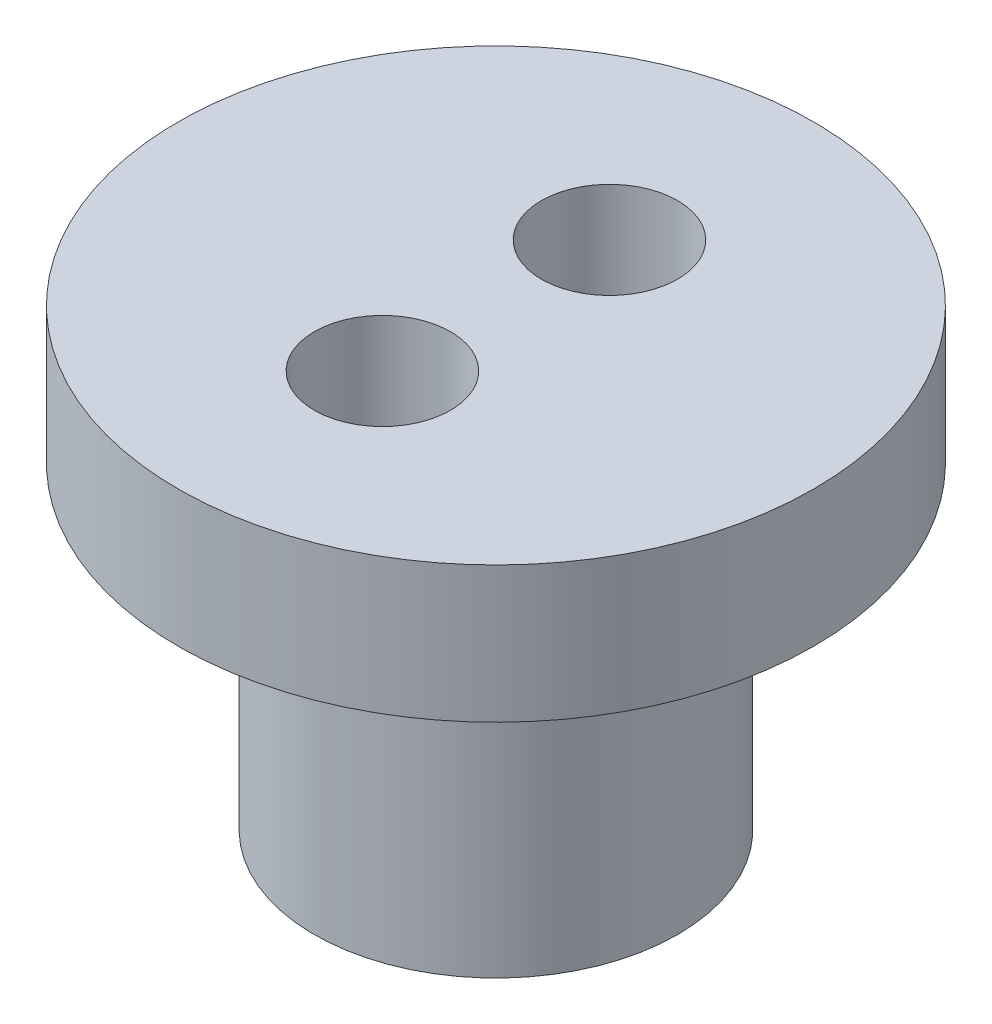
ISO-10303-21;
HEADER;
FILE_DESCRIPTION(('STEP AP214'),'2;1');
FILE_NAME('part.step','',(''),(''),'','','');
FILE_SCHEMA(('AUTOMOTIVE_DESIGN { 1 0 10303 214 1 1 1 1 }'));
ENDSEC;
DATA;
#1=APPLICATION_CONTEXT('core data for automotive mechanical design processes');
#2=APPLICATION_PROTOCOL_DEFINITION('international standard','automotive_design',2000,#1);
#3=PRODUCT_CONTEXT('',#1,'mechanical');
#4=PRODUCT('Part','Part','',(#3));
#5=PRODUCT_RELATED_PRODUCT_CATEGORY('part','',(#4));
#6=PRODUCT_DEFINITION_FORMATION('','',#4);
#7=PRODUCT_DEFINITION_CONTEXT('part definition',#1,'design');
#8=PRODUCT_DEFINITION('design','',#6,#7);
#9=PRODUCT_DEFINITION_SHAPE('','',#8);
#10=(LENGTH_UNIT() NAMED_UNIT(*) SI_UNIT(.MILLI.,.METRE.));
#11=(NAMED_UNIT(*) PLANE_ANGLE_UNIT() SI_UNIT($,.RADIAN.));
#12=(NAMED_UNIT(*) SI_UNIT($,.STERADIAN.) SOLID_ANGLE_UNIT());
#13=UNCERTAINTY_MEASURE_WITH_UNIT(LENGTH_MEASURE(1.E-05),#10,'distance_accuracy_value','');
#14=(GEOMETRIC_REPRESENTATION_CONTEXT(3) GLOBAL_UNCERTAINTY_ASSIGNED_CONTEXT((#13)) GLOBAL_UNIT_ASSIGNED_CONTEXT((#10,
#11,#12)) REPRESENTATION_CONTEXT('',''));
#15=CARTESIAN_POINT('',(0.,0.,0.));
#16=DIRECTION('',(0.,0.,1.));
#17=DIRECTION('',(1.,0.,0.));
#18=AXIS2_PLACEMENT_3D('',#15,#16,#17);
#19=CARTESIAN_POINT('',(4.,0.,0.));
#20=DIRECTION('',(0.,-1.,0.));
#21=DIRECTION('',(1.,0.,0.));
#22=AXIS2_PLACEMENT_3D('',#19,#20,#21);
#23=PLANE('',#22);
#24=CARTESIAN_POINT('',(0.,0.,0.));
#25=DIRECTION('',(0.,-1.,0.));
#26=DIRECTION('',(1.,0.,0.));
#27=AXIS2_PLACEMENT_3D('',#24,#25,#26);
#28=CIRCLE('',#27,4.);
#29=CARTESIAN_POINT('',(4.,0.,0.));
#30=VERTEX_POINT('',#29);
#31=EDGE_CURVE('E74',#30,#30,#28,.T.);
#32=ORIENTED_EDGE('',*,*,#31,.T.);
#33=EDGE_LOOP('',(#32));
#34=FACE_BOUND('',#33,.T.);
#35=CARTESIAN_POINT('',(0.,0.,0.));
#36=DIRECTION('',(0.,-1.,0.));
#37=DIRECTION('',(1.,0.,0.));
#38=AXIS2_PLACEMENT_3D('',#35,#36,#37);
#39=CIRCLE('',#38,2.);
#40=CARTESIAN_POINT('',(2.,0.,0.));
#41=VERTEX_POINT('',#40);
#42=EDGE_CURVE('E54',#41,#41,#39,.T.);
#43=ORIENTED_EDGE('',*,*,#42,.F.);
#44=EDGE_LOOP('',(#43));
#45=FACE_BOUND('',#44,.T.);
#46=ADVANCED_FACE('F40',(#34,#45),#23,.T.);
#47=CARTESIAN_POINT('',(0.,4.,0.));
#48=DIRECTION('',(0.,-1.,0.));
#49=DIRECTION('',(1.,0.,0.));
#50=AXIS2_PLACEMENT_3D('',#47,#48,#49);
#51=CYLINDRICAL_SURFACE('',#50,2.);
#52=ORIENTED_EDGE('',*,*,#42,.T.);
#53=EDGE_LOOP('',(#52));
#54=FACE_BOUND('',#53,.T.);
#55=CARTESIAN_POINT('',(0.,4.,0.));
#56=DIRECTION('',(0.,-1.,0.));
#57=DIRECTION('',(1.,0.,0.));
#58=AXIS2_PLACEMENT_3D('',#55,#56,#57);
#59=CIRCLE('',#58,2.);
#60=CARTESIAN_POINT('',(2.,4.,0.));
#61=VERTEX_POINT('',#60);
#62=EDGE_CURVE('E60',#61,#61,#59,.T.);
#63=ORIENTED_EDGE('',*,*,#62,.F.);
#64=EDGE_LOOP('',(#63));
#65=FACE_BOUND('',#64,.T.);
#66=ADVANCED_FACE('F129',(#54,#65),#51,.F.);
#67=CARTESIAN_POINT('',(2.,4.,0.));
#68=DIRECTION('',(0.,-1.,0.));
#69=DIRECTION('',(1.,0.,0.));
#70=AXIS2_PLACEMENT_3D('',#67,#68,#69);
#71=PLANE('',#70);
#72=ORIENTED_EDGE('',*,*,#62,.T.);
#73=EDGE_LOOP('',(#72));
#74=FACE_BOUND('',#73,.T.);
#75=ADVANCED_FACE('F109',(#74),#71,.T.);
#76=CARTESIAN_POINT('',(0.,10.,0.));
#77=DIRECTION('',(0.,1.,0.));
#78=DIRECTION('',(-1.,0.,0.));
#79=AXIS2_PLACEMENT_3D('',#76,#77,#78);
#80=PLANE('',#79);
#81=CARTESIAN_POINT('',(0.,10.,-2.5));
#82=DIRECTION('',(0.,1.,0.));
#83=DIRECTION('',(-1.,0.,0.));
#84=AXIS2_PLACEMENT_3D('',#81,#82,#83);
#85=CIRCLE('',#84,1.5);
#86=CARTESIAN_POINT('',(-1.5,10.,-2.5));
#87=VERTEX_POINT('',#86);
#88=EDGE_CURVE('E87',#87,#87,#85,.T.);
#89=ORIENTED_EDGE('',*,*,#88,.F.);
#90=EDGE_LOOP('',(#89));
#91=FACE_BOUND('',#90,.T.);
#92=CARTESIAN_POINT('',(0.,10.,2.5));
#93=DIRECTION('',(0.,1.,0.));
#94=DIRECTION('',(-1.,0.,0.));
#95=AXIS2_PLACEMENT_3D('',#92,#93,#94);
#96=CIRCLE('',#95,1.5);
#97=CARTESIAN_POINT('',(-1.5,10.,2.5));
#98=VERTEX_POINT('',#97);
#99=EDGE_CURVE('E79',#98,#98,#96,.T.);
#100=ORIENTED_EDGE('',*,*,#99,.F.);
#101=EDGE_LOOP('',(#100));
#102=FACE_BOUND('',#101,.T.);
#103=CARTESIAN_POINT('',(0.,10.,0.));
#104=DIRECTION('',(0.,-1.,0.));
#105=DIRECTION('',(1.,0.,0.));
#106=AXIS2_PLACEMENT_3D('',#103,#104,#105);
#107=CIRCLE('',#106,7.);
#108=CARTESIAN_POINT('',(7.,10.,0.));
#109=VERTEX_POINT('',#108);
#110=EDGE_CURVE('E66',#109,#109,#107,.T.);
#111=ORIENTED_EDGE('',*,*,#110,.F.);
#112=EDGE_LOOP('',(#111));
#113=FACE_BOUND('',#112,.T.);
#114=ADVANCED_FACE('F105',(#91,#102,#113),#80,.T.);
#115=CARTESIAN_POINT('',(0.,4.,0.));
#116=DIRECTION('',(0.,-1.,0.));
#117=DIRECTION('',(1.,0.,0.));
#118=AXIS2_PLACEMENT_3D('',#115,#116,#117);
#119=CYLINDRICAL_SURFACE('',#118,7.);
#120=ORIENTED_EDGE('',*,*,#110,.T.);
#121=EDGE_LOOP('',(#120));
#122=FACE_BOUND('',#121,.T.);
#123=CARTESIAN_POINT('',(0.,7.,0.));
#124=DIRECTION('',(0.,-1.,0.));
#125=DIRECTION('',(1.,0.,0.));
#126=AXIS2_PLACEMENT_3D('',#123,#124,#125);
#127=CIRCLE('',#126,7.);
#128=CARTESIAN_POINT('',(7.,7.,0.));
#129=VERTEX_POINT('',#128);
#130=EDGE_CURVE('E70',#129,#129,#127,.T.);
#131=ORIENTED_EDGE('',*,*,#130,.F.);
#132=EDGE_LOOP('',(#131));
#133=FACE_BOUND('',#132,.T.);
#134=ADVANCED_FACE('F108',(#122,#133),#119,.T.);
#135=CARTESIAN_POINT('',(7.,7.,0.));
#136=DIRECTION('',(0.,-1.,0.));
#137=DIRECTION('',(1.,0.,0.));
#138=AXIS2_PLACEMENT_3D('',#135,#136,#137);
#139=PLANE('',#138);
#140=CARTESIAN_POINT('',(0.,7.,0.));
#141=DIRECTION('',(0.,-1.,0.));
#142=DIRECTION('',(1.,0.,0.));
#143=AXIS2_PLACEMENT_3D('',#140,#141,#142);
#144=CIRCLE('',#143,5.);
#145=CARTESIAN_POINT('',(5.,7.,0.));
#146=VERTEX_POINT('',#145);
#147=EDGE_CURVE('E10',#146,#146,#144,.F.);
#148=ORIENTED_EDGE('',*,*,#147,.T.);
#149=EDGE_LOOP('',(#148));
#150=FACE_BOUND('',#149,.T.);
#151=ORIENTED_EDGE('',*,*,#130,.T.);
#152=EDGE_LOOP('',(#151));
#153=FACE_BOUND('',#152,.T.);
#154=ADVANCED_FACE('F117',(#150,#153),#139,.T.);
#155=CARTESIAN_POINT('',(0.,4.,0.));
#156=DIRECTION('',(0.,-1.,0.));
#157=DIRECTION('',(1.,0.,0.));
#158=AXIS2_PLACEMENT_3D('',#155,#156,#157);
#159=CYLINDRICAL_SURFACE('',#158,4.);
#160=CARTESIAN_POINT('',(0.,6.,0.));
#161=DIRECTION('',(0.,-1.,0.));
#162=DIRECTION('',(1.,0.,0.));
#163=AXIS2_PLACEMENT_3D('',#160,#161,#162);
#164=CIRCLE('',#163,4.);
#165=CARTESIAN_POINT('',(4.,6.,0.));
#166=VERTEX_POINT('',#165);
#167=EDGE_CURVE('E48',#166,#166,#164,.T.);
#168=ORIENTED_EDGE('',*,*,#167,.T.);
#169=EDGE_LOOP('',(#168));
#170=FACE_BOUND('',#169,.T.);
#171=ORIENTED_EDGE('',*,*,#31,.F.);
#172=EDGE_LOOP('',(#171));
#173=FACE_BOUND('',#172,.T.);
#174=ADVANCED_FACE('F122',(#170,#173),#159,.T.);
#175=CARTESIAN_POINT('',(0.,6.,0.));
#176=DIRECTION('',(0.,-1.,0.));
#177=DIRECTION('',(1.,0.,0.));
#178=AXIS2_PLACEMENT_3D('',#175,#176,#177);
#179=TOROIDAL_SURFACE('',#178,5.,1.);
#180=ORIENTED_EDGE('',*,*,#147,.F.);
#181=EDGE_LOOP('',(#180));
#182=FACE_BOUND('',#181,.T.);
#183=ORIENTED_EDGE('',*,*,#167,.F.);
#184=EDGE_LOOP('',(#183));
#185=FACE_BOUND('',#184,.T.);
#186=ADVANCED_FACE('F42',(#182,#185),#179,.F.);
#187=CARTESIAN_POINT('',(0.,7.,2.5));
#188=DIRECTION('',(0.,1.,0.));
#189=DIRECTION('',(-1.,0.,0.));
#190=AXIS2_PLACEMENT_3D('',#187,#188,#189);
#191=CYLINDRICAL_SURFACE('',#190,1.5);
#192=CARTESIAN_POINT('',(0.,7.,2.5));
#193=DIRECTION('',(0.,1.,0.));
#194=DIRECTION('',(-1.,0.,0.));
#195=AXIS2_PLACEMENT_3D('',#192,#193,#194);
#196=CIRCLE('',#195,1.5);
#197=CARTESIAN_POINT('',(-1.5,7.,2.5));
#198=VERTEX_POINT('',#197);
#199=EDGE_CURVE('E83',#198,#198,#196,.T.);
#200=ORIENTED_EDGE('',*,*,#199,.F.);
#201=EDGE_LOOP('',(#200));
#202=FACE_BOUND('',#201,.T.);
#203=ORIENTED_EDGE('',*,*,#99,.T.);
#204=EDGE_LOOP('',(#203));
#205=FACE_BOUND('',#204,.T.);
#206=ADVANCED_FACE('F173',(#202,#205),#191,.F.);
#207=CARTESIAN_POINT('',(0.,7.,2.5));
#208=DIRECTION('',(0.,1.,0.));
#209=DIRECTION('',(-1.,0.,0.));
#210=AXIS2_PLACEMENT_3D('',#207,#208,#209);
#211=PLANE('',#210);
#212=ORIENTED_EDGE('',*,*,#199,.T.);
#213=EDGE_LOOP('',(#212));
#214=FACE_BOUND('',#213,.T.);
#215=ADVANCED_FACE('F101',(#214),#211,.T.);
#216=CARTESIAN_POINT('',(0.,7.,-2.5));
#217=DIRECTION('',(0.,1.,0.));
#218=DIRECTION('',(-1.,0.,0.));
#219=AXIS2_PLACEMENT_3D('',#216,#217,#218);
#220=CYLINDRICAL_SURFACE('',#219,1.5);
#221=CARTESIAN_POINT('',(0.,7.,-2.5));
#222=DIRECTION('',(0.,1.,0.));
#223=DIRECTION('',(-1.,0.,0.));
#224=AXIS2_PLACEMENT_3D('',#221,#222,#223);
#225=CIRCLE('',#224,1.5);
#226=CARTESIAN_POINT('',(-1.5,7.,-2.5));
#227=VERTEX_POINT('',#226);
#228=EDGE_CURVE('E78',#227,#227,#225,.T.);
#229=ORIENTED_EDGE('',*,*,#228,.F.);
#230=EDGE_LOOP('',(#229));
#231=FACE_BOUND('',#230,.T.);
#232=ORIENTED_EDGE('',*,*,#88,.T.);
#233=EDGE_LOOP('',(#232));
#234=FACE_BOUND('',#233,.T.);
#235=ADVANCED_FACE('F98',(#231,#234),#220,.F.);
#236=CARTESIAN_POINT('',(0.,7.,-2.5));
#237=DIRECTION('',(0.,1.,0.));
#238=DIRECTION('',(-1.,0.,0.));
#239=AXIS2_PLACEMENT_3D('',#236,#237,#238);
#240=PLANE('',#239);
#241=ORIENTED_EDGE('',*,*,#228,.T.);
#242=EDGE_LOOP('',(#241));
#243=FACE_BOUND('',#242,.T.);
#244=ADVANCED_FACE('F96',(#243),#240,.T.);
#245=CLOSED_SHELL('',(#46,#66,#75,#114,#134,#154,#174,#186,#206,#215,#235,#244));
#246=MANIFOLD_SOLID_BREP('B2',#245);
#247=ADVANCED_BREP_SHAPE_REPRESENTATION('',(#18,#246),#14);
#248=SHAPE_DEFINITION_REPRESENTATION(#9,#247);
ENDSEC;
END-ISO-10303-21;
